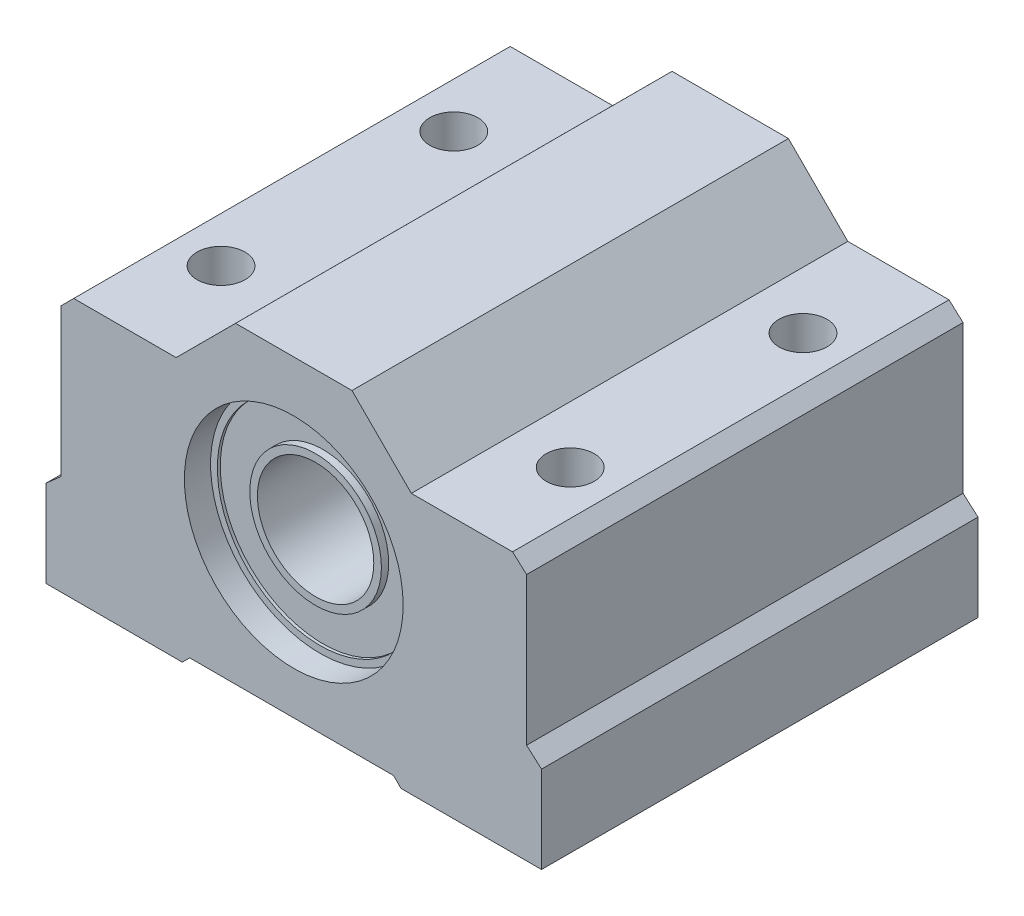
ISO-10303-21;
HEADER;
FILE_DESCRIPTION(('STEP AP214'),'2;1');
FILE_NAME('part.step','',(''),(''),'','','');
FILE_SCHEMA(('AUTOMOTIVE_DESIGN { 1 0 10303 214 1 1 1 1 }'));
ENDSEC;
DATA;
#1=APPLICATION_CONTEXT('core data for automotive mechanical design processes');
#2=APPLICATION_PROTOCOL_DEFINITION('international standard','automotive_design',2000,#1);
#3=PRODUCT_CONTEXT('',#1,'mechanical');
#4=PRODUCT('Part','Part','',(#3));
#5=PRODUCT_RELATED_PRODUCT_CATEGORY('part','',(#4));
#6=PRODUCT_DEFINITION_FORMATION('','',#4);
#7=PRODUCT_DEFINITION_CONTEXT('part definition',#1,'design');
#8=PRODUCT_DEFINITION('design','',#6,#7);
#9=PRODUCT_DEFINITION_SHAPE('','',#8);
#10=(LENGTH_UNIT() NAMED_UNIT(*) SI_UNIT(.MILLI.,.METRE.));
#11=(NAMED_UNIT(*) PLANE_ANGLE_UNIT() SI_UNIT($,.RADIAN.));
#12=(NAMED_UNIT(*) SI_UNIT($,.STERADIAN.) SOLID_ANGLE_UNIT());
#13=UNCERTAINTY_MEASURE_WITH_UNIT(LENGTH_MEASURE(1.E-05),#10,'distance_accuracy_value','');
#14=(GEOMETRIC_REPRESENTATION_CONTEXT(3) GLOBAL_UNCERTAINTY_ASSIGNED_CONTEXT((#13)) GLOBAL_UNIT_ASSIGNED_CONTEXT((#10,
#11,#12)) REPRESENTATION_CONTEXT('',''));
#15=CARTESIAN_POINT('',(0.,0.,0.));
#16=DIRECTION('',(0.,0.,1.));
#17=DIRECTION('',(1.,0.,0.));
#18=AXIS2_PLACEMENT_3D('',#15,#16,#17);
#19=CARTESIAN_POINT('',(0.,0.,-30.));
#20=DIRECTION('',(0.,0.,1.));
#21=DIRECTION('',(1.,0.,0.));
#22=AXIS2_PLACEMENT_3D('',#19,#20,#21);
#23=PLANE('',#22);
#24=DIRECTION('',(-0.748408560935745,-0.663237985882961,0.));
#25=VECTOR('',#24,1.);
#26=CARTESIAN_POINT('',(-5.00715940899254,5.65016034579369,-30.));
#27=LINE('',#26,#25);
#28=CARTESIAN_POINT('',(-15.9972160814821,-4.08920319527542,-30.));
#29=VERTEX_POINT('',#28);
#30=CARTESIAN_POINT('',(-17.03,-5.00445398438139,-30.));
#31=VERTEX_POINT('',#30);
#32=EDGE_CURVE('E253',#29,#31,#27,.T.);
#33=ORIENTED_EDGE('',*,*,#32,.F.);
#34=DIRECTION('',(0.,-1.,0.));
#35=VECTOR('',#34,1.);
#36=CARTESIAN_POINT('',(-15.9972160814821,0.,-30.));
#37=LINE('',#36,#35);
#38=CARTESIAN_POINT('',(-15.9972160814821,6.07141612040069,-30.));
#39=VERTEX_POINT('',#38);
#40=EDGE_CURVE('E191',#39,#29,#37,.T.);
#41=ORIENTED_EDGE('',*,*,#40,.F.);
#42=DIRECTION('',(-0.707106781186547,-0.707106781186548,0.));
#43=VECTOR('',#42,1.);
#44=CARTESIAN_POINT('',(-11.0343161009414,11.0343161009414,-30.));
#45=LINE('',#44,#43);
#46=CARTESIAN_POINT('',(-15.1243670871386,6.94426511474419,-30.));
#47=VERTEX_POINT('',#46);
#48=EDGE_CURVE('E176',#47,#39,#45,.T.);
#49=ORIENTED_EDGE('',*,*,#48,.F.);
#50=DIRECTION('',(-1.,0.,0.));
#51=VECTOR('',#50,1.);
#52=CARTESIAN_POINT('',(0.,6.9442651147442,-30.));
#53=LINE('',#52,#51);
#54=CARTESIAN_POINT('',(-8.083891516657,6.94426511474419,-30.));
#55=VERTEX_POINT('',#54);
#56=EDGE_CURVE('E189',#55,#47,#53,.T.);
#57=ORIENTED_EDGE('',*,*,#56,.F.);
#58=DIRECTION('',(-0.707276659522601,-0.706936862028393,0.));
#59=VECTOR('',#58,1.);
#60=CARTESIAN_POINT('',(-7.51213557308124,7.51574636915227,-30.));
#61=LINE('',#60,#59);
#62=CARTESIAN_POINT('',(-4.,11.0261946041163,-30.));
#63=VERTEX_POINT('',#62);
#64=EDGE_CURVE('E194',#63,#55,#61,.T.);
#65=ORIENTED_EDGE('',*,*,#64,.F.);
#66=DIRECTION('',(-1.,0.,0.));
#67=VECTOR('',#66,1.);
#68=CARTESIAN_POINT('',(0.,11.0261946041163,-30.));
#69=LINE('',#68,#67);
#70=CARTESIAN_POINT('',(4.,11.0261946041163,-30.));
#71=VERTEX_POINT('',#70);
#72=EDGE_CURVE('E196',#71,#63,#69,.T.);
#73=ORIENTED_EDGE('',*,*,#72,.F.);
#74=DIRECTION('',(-0.707106781186548,0.707106781186547,0.));
#75=VECTOR('',#74,1.);
#76=CARTESIAN_POINT('',(7.51309730205813,7.51309730205814,-30.));
#77=LINE('',#76,#75);
#78=CARTESIAN_POINT('',(8.0819294893721,6.94426511474417,-30.));
#79=VERTEX_POINT('',#78);
#80=EDGE_CURVE('E385',#79,#71,#77,.T.);
#81=ORIENTED_EDGE('',*,*,#80,.F.);
#82=DIRECTION('',(-1.,0.,0.));
#83=VECTOR('',#82,1.);
#84=CARTESIAN_POINT('',(0.,6.94426511474417,-30.));
#85=LINE('',#84,#83);
#86=CARTESIAN_POINT('',(15.0374546179448,6.94426511474418,-30.));
#87=VERTEX_POINT('',#86);
#88=EDGE_CURVE('E382',#87,#79,#85,.T.);
#89=ORIENTED_EDGE('',*,*,#88,.F.);
#90=DIRECTION('',(-0.741743771294362,0.670683366236272,0.));
#91=VECTOR('',#90,1.);
#92=CARTESIAN_POINT('',(10.2186901014741,11.301383208728,-30.));
#93=LINE('',#92,#91);
#94=CARTESIAN_POINT('',(16.0027839185179,6.07141612040066,-30.));
#95=VERTEX_POINT('',#94);
#96=EDGE_CURVE('E379',#95,#87,#93,.T.);
#97=ORIENTED_EDGE('',*,*,#96,.F.);
#98=DIRECTION('',(0.,1.,0.));
#99=VECTOR('',#98,1.);
#100=CARTESIAN_POINT('',(16.0027839185179,0.,-30.));
#101=LINE('',#100,#99);
#102=CARTESIAN_POINT('',(16.0027839185179,-4.08920319527547,-30.));
#103=VERTEX_POINT('',#102);
#104=EDGE_CURVE('E376',#103,#95,#101,.T.);
#105=ORIENTED_EDGE('',*,*,#104,.F.);
#106=DIRECTION('',(-0.749951735571776,0.661492550459097,0.));
#107=VECTOR('',#106,1.);
#108=CARTESIAN_POINT('',(4.97377394084638,5.63890008540626,-30.));
#109=LINE('',#108,#107);
#110=CARTESIAN_POINT('',(17.03,-4.99525588291164,-30.));
#111=VERTEX_POINT('',#110);
#112=EDGE_CURVE('E373',#111,#103,#109,.T.);
#113=ORIENTED_EDGE('',*,*,#112,.F.);
#114=DIRECTION('',(0.,1.,0.));
#115=VECTOR('',#114,1.);
#116=CARTESIAN_POINT('',(17.03,0.,-30.));
#117=LINE('',#116,#115);
#118=CARTESIAN_POINT('',(17.03,-10.9738053958837,-30.));
#119=VERTEX_POINT('',#118);
#120=EDGE_CURVE('E370',#119,#111,#117,.T.);
#121=ORIENTED_EDGE('',*,*,#120,.F.);
#122=DIRECTION('',(1.,0.,0.));
#123=VECTOR('',#122,1.);
#124=CARTESIAN_POINT('',(0.,-10.9738053958837,-30.));
#125=LINE('',#124,#123);
#126=CARTESIAN_POINT('',(7.36706184571891,-10.9738053958837,-30.));
#127=VERTEX_POINT('',#126);
#128=EDGE_CURVE('E367',#127,#119,#125,.T.);
#129=ORIENTED_EDGE('',*,*,#128,.F.);
#130=DIRECTION('',(0.707106781186548,-0.707106781186547,0.));
#131=VECTOR('',#130,1.);
#132=CARTESIAN_POINT('',(-1.80337177508242,-1.80337177508242,-30.));
#133=LINE('',#132,#131);
#134=CARTESIAN_POINT('',(6.85761623335725,-10.4643597835221,-30.));
#135=VERTEX_POINT('',#134);
#136=EDGE_CURVE('E364',#135,#127,#133,.T.);
#137=ORIENTED_EDGE('',*,*,#136,.F.);
#138=DIRECTION('',(1.,0.,0.));
#139=VECTOR('',#138,1.);
#140=CARTESIAN_POINT('',(0.,-10.4643597835221,-30.));
#141=LINE('',#140,#139);
#142=CARTESIAN_POINT('',(-7.15322917727557,-10.4643597835221,-30.));
#143=VERTEX_POINT('',#142);
#144=EDGE_CURVE('E361',#143,#135,#141,.T.);
#145=ORIENTED_EDGE('',*,*,#144,.F.);
#146=DIRECTION('',(0.707106781186549,0.707106781186546,0.));
#147=VECTOR('',#146,1.);
#148=CARTESIAN_POINT('',(1.65556530312327,-1.65556530312328,-30.));
#149=LINE('',#148,#147);
#150=CARTESIAN_POINT('',(-7.66267478963722,-10.9738053958837,-30.));
#151=VERTEX_POINT('',#150);
#152=EDGE_CURVE('E358',#151,#143,#149,.T.);
#153=ORIENTED_EDGE('',*,*,#152,.F.);
#154=DIRECTION('',(1.,0.,0.));
#155=VECTOR('',#154,1.);
#156=CARTESIAN_POINT('',(0.,-10.9738053958837,-30.));
#157=LINE('',#156,#155);
#158=CARTESIAN_POINT('',(-17.03,-10.9738053958837,-30.));
#159=VERTEX_POINT('',#158);
#160=EDGE_CURVE('E355',#159,#151,#157,.T.);
#161=ORIENTED_EDGE('',*,*,#160,.F.);
#162=DIRECTION('',(0.,-1.,0.));
#163=VECTOR('',#162,1.);
#164=CARTESIAN_POINT('',(-17.03,0.,-30.));
#165=LINE('',#164,#163);
#166=EDGE_CURVE('E353',#31,#159,#165,.T.);
#167=ORIENTED_EDGE('',*,*,#166,.F.);
#168=EDGE_LOOP('',(#33,#41,#49,#57,#65,#73,#81,#89,#97,#105,#113,#121,#129,#137,#145,#153,#161,#167));
#169=FACE_BOUND('',#168,.T.);
#170=CARTESIAN_POINT('',(0.,0.,-30.));
#171=DIRECTION('',(0.,0.,1.));
#172=DIRECTION('',(1.,0.,0.));
#173=AXIS2_PLACEMENT_3D('',#170,#171,#172);
#174=CIRCLE('',#173,7.51901731530374);
#175=CARTESIAN_POINT('',(7.51901731530374,0.,-30.));
#176=VERTEX_POINT('',#175);
#177=EDGE_CURVE('E328',#176,#176,#174,.T.);
#178=ORIENTED_EDGE('',*,*,#177,.T.);
#179=EDGE_LOOP('',(#178));
#180=FACE_BOUND('',#179,.T.);
#181=ADVANCED_FACE('F42',(#169,#180),#23,.F.);
#182=CARTESIAN_POINT('',(0.,0.,-2.));
#183=DIRECTION('',(0.,0.,1.));
#184=DIRECTION('',(1.,0.,0.));
#185=AXIS2_PLACEMENT_3D('',#182,#183,#184);
#186=CYLINDRICAL_SURFACE('',#185,7.0517883155918);
#187=CARTESIAN_POINT('',(0.,0.,-2.));
#188=DIRECTION('',(0.,0.,1.));
#189=DIRECTION('',(1.,0.,0.));
#190=AXIS2_PLACEMENT_3D('',#187,#188,#189);
#191=CIRCLE('',#190,7.0517883155918);
#192=CARTESIAN_POINT('',(7.0517883155918,0.,-2.));
#193=VERTEX_POINT('',#192);
#194=EDGE_CURVE('E335',#193,#193,#191,.T.);
#195=ORIENTED_EDGE('',*,*,#194,.F.);
#196=EDGE_LOOP('',(#195));
#197=FACE_BOUND('',#196,.T.);
#198=CARTESIAN_POINT('',(0.,0.,-1.8));
#199=DIRECTION('',(0.,0.,1.));
#200=DIRECTION('',(1.,0.,0.));
#201=AXIS2_PLACEMENT_3D('',#198,#199,#200);
#202=CIRCLE('',#201,7.0517883155918);
#203=CARTESIAN_POINT('',(7.0517883155918,0.,-1.8));
#204=VERTEX_POINT('',#203);
#205=EDGE_CURVE('E321',#204,#204,#202,.T.);
#206=ORIENTED_EDGE('',*,*,#205,.T.);
#207=EDGE_LOOP('',(#206));
#208=FACE_BOUND('',#207,.T.);
#209=ADVANCED_FACE('F297',(#197,#208),#186,.F.);
#210=CARTESIAN_POINT('',(0.,0.,-28.5));
#211=DIRECTION('',(0.,0.,1.));
#212=DIRECTION('',(1.,0.,0.));
#213=AXIS2_PLACEMENT_3D('',#210,#211,#212);
#214=CYLINDRICAL_SURFACE('',#213,4.);
#215=CARTESIAN_POINT('',(0.,0.,-28.5));
#216=DIRECTION('',(0.,0.,1.));
#217=DIRECTION('',(1.,0.,0.));
#218=AXIS2_PLACEMENT_3D('',#215,#216,#217);
#219=CIRCLE('',#218,4.);
#220=CARTESIAN_POINT('',(4.,0.,-28.5));
#221=VERTEX_POINT('',#220);
#222=EDGE_CURVE('E344',#221,#221,#219,.T.);
#223=ORIENTED_EDGE('',*,*,#222,.F.);
#224=EDGE_LOOP('',(#223));
#225=FACE_BOUND('',#224,.T.);
#226=CARTESIAN_POINT('',(0.,0.,-1.5));
#227=DIRECTION('',(0.,0.,1.));
#228=DIRECTION('',(1.,0.,0.));
#229=AXIS2_PLACEMENT_3D('',#226,#227,#228);
#230=CIRCLE('',#229,4.);
#231=CARTESIAN_POINT('',(4.,0.,-1.5));
#232=VERTEX_POINT('',#231);
#233=EDGE_CURVE('E341',#232,#232,#230,.T.);
#234=ORIENTED_EDGE('',*,*,#233,.T.);
#235=EDGE_LOOP('',(#234));
#236=FACE_BOUND('',#235,.T.);
#237=ADVANCED_FACE('F302',(#225,#236),#214,.F.);
#238=CARTESIAN_POINT('',(0.,0.,-30.));
#239=DIRECTION('',(0.,0.,1.));
#240=DIRECTION('',(1.,0.,0.));
#241=AXIS2_PLACEMENT_3D('',#238,#239,#240);
#242=CYLINDRICAL_SURFACE('',#241,7.0517883155918);
#243=CARTESIAN_POINT('',(0.,0.,-28.2));
#244=DIRECTION('',(0.,0.,1.));
#245=DIRECTION('',(1.,0.,0.));
#246=AXIS2_PLACEMENT_3D('',#243,#244,#245);
#247=CIRCLE('',#246,7.0517883155918);
#248=CARTESIAN_POINT('',(7.0517883155918,0.,-28.2));
#249=VERTEX_POINT('',#248);
#250=EDGE_CURVE('E485',#249,#249,#247,.T.);
#251=ORIENTED_EDGE('',*,*,#250,.F.);
#252=EDGE_LOOP('',(#251));
#253=FACE_BOUND('',#252,.T.);
#254=CARTESIAN_POINT('',(0.,0.,-28.));
#255=DIRECTION('',(0.,0.,1.));
#256=DIRECTION('',(1.,0.,0.));
#257=AXIS2_PLACEMENT_3D('',#254,#255,#256);
#258=CIRCLE('',#257,7.0517883155918);
#259=CARTESIAN_POINT('',(7.0517883155918,0.,-28.));
#260=VERTEX_POINT('',#259);
#261=EDGE_CURVE('E12',#260,#260,#258,.F.);
#262=ORIENTED_EDGE('',*,*,#261,.F.);
#263=EDGE_LOOP('',(#262));
#264=FACE_BOUND('',#263,.T.);
#265=ADVANCED_FACE('F294',(#253,#264),#242,.F.);
#266=CARTESIAN_POINT('',(-5.00715940899254,5.65016034579369,-30.));
#267=DIRECTION('',(-0.663237985882961,0.748408560935745,0.));
#268=DIRECTION('',(-0.748408560935745,-0.663237985882961,0.));
#269=AXIS2_PLACEMENT_3D('',#266,#267,#268);
#270=PLANE('',#269);
#271=DIRECTION('',(-0.748408560935745,-0.663237985882961,0.));
#272=VECTOR('',#271,1.);
#273=CARTESIAN_POINT('',(-5.00715940899254,5.65016034579369,0.));
#274=LINE('',#273,#272);
#275=CARTESIAN_POINT('',(-15.9972160814821,-4.08920319527542,0.));
#276=VERTEX_POINT('',#275);
#277=CARTESIAN_POINT('',(-17.03,-5.00445398438139,0.));
#278=VERTEX_POINT('',#277);
#279=EDGE_CURVE('E201',#276,#278,#274,.T.);
#280=ORIENTED_EDGE('',*,*,#279,.F.);
#281=DIRECTION('',(0.,0.,1.));
#282=VECTOR('',#281,1.);
#283=CARTESIAN_POINT('',(-15.9972160814821,-4.08920319527542,-30.));
#284=LINE('',#283,#282);
#285=EDGE_CURVE('E51',#29,#276,#284,.T.);
#286=ORIENTED_EDGE('',*,*,#285,.F.);
#287=ORIENTED_EDGE('',*,*,#32,.T.);
#288=DIRECTION('',(0.,0.,1.));
#289=VECTOR('',#288,1.);
#290=CARTESIAN_POINT('',(-17.03,-5.00445398438139,-30.));
#291=LINE('',#290,#289);
#292=EDGE_CURVE('E129',#31,#278,#291,.T.);
#293=ORIENTED_EDGE('',*,*,#292,.T.);
#294=EDGE_LOOP('',(#280,#286,#287,#293));
#295=FACE_BOUND('',#294,.T.);
#296=ADVANCED_FACE('F44',(#295),#270,.T.);
#297=CARTESIAN_POINT('',(-15.9972160814821,0.,-30.));
#298=DIRECTION('',(-1.,0.,0.));
#299=DIRECTION('',(0.,0.,1.));
#300=AXIS2_PLACEMENT_3D('',#297,#298,#299);
#301=PLANE('',#300);
#302=DIRECTION('',(0.,-1.,0.));
#303=VECTOR('',#302,1.);
#304=CARTESIAN_POINT('',(-15.9972160814821,0.,0.));
#305=LINE('',#304,#303);
#306=CARTESIAN_POINT('',(-15.9972160814821,6.07141612040069,0.));
#307=VERTEX_POINT('',#306);
#308=EDGE_CURVE('E250',#307,#276,#305,.T.);
#309=ORIENTED_EDGE('',*,*,#308,.F.);
#310=DIRECTION('',(0.,0.,1.));
#311=VECTOR('',#310,1.);
#312=CARTESIAN_POINT('',(-15.9972160814821,6.07141612040069,-30.));
#313=LINE('',#312,#311);
#314=EDGE_CURVE('E117',#39,#307,#313,.T.);
#315=ORIENTED_EDGE('',*,*,#314,.F.);
#316=ORIENTED_EDGE('',*,*,#40,.T.);
#317=ORIENTED_EDGE('',*,*,#285,.T.);
#318=EDGE_LOOP('',(#309,#315,#316,#317));
#319=FACE_BOUND('',#318,.T.);
#320=ADVANCED_FACE('F286',(#319),#301,.T.);
#321=CARTESIAN_POINT('',(-11.0343161009414,11.0343161009414,-30.));
#322=DIRECTION('',(-0.707106781186548,0.707106781186547,0.));
#323=DIRECTION('',(-0.707106781186547,-0.707106781186548,0.));
#324=AXIS2_PLACEMENT_3D('',#321,#322,#323);
#325=PLANE('',#324);
#326=DIRECTION('',(-0.707106781186547,-0.707106781186548,0.));
#327=VECTOR('',#326,1.);
#328=CARTESIAN_POINT('',(-11.0343161009414,11.0343161009414,0.));
#329=LINE('',#328,#327);
#330=CARTESIAN_POINT('',(-15.1243670871386,6.94426511474419,0.));
#331=VERTEX_POINT('',#330);
#332=EDGE_CURVE('E178',#331,#307,#329,.T.);
#333=ORIENTED_EDGE('',*,*,#332,.F.);
#334=DIRECTION('',(0.,0.,1.));
#335=VECTOR('',#334,1.);
#336=CARTESIAN_POINT('',(-15.1243670871386,6.94426511474419,-30.));
#337=LINE('',#336,#335);
#338=EDGE_CURVE('E173',#47,#331,#337,.T.);
#339=ORIENTED_EDGE('',*,*,#338,.F.);
#340=ORIENTED_EDGE('',*,*,#48,.T.);
#341=ORIENTED_EDGE('',*,*,#314,.T.);
#342=EDGE_LOOP('',(#333,#339,#340,#341));
#343=FACE_BOUND('',#342,.T.);
#344=ADVANCED_FACE('F175',(#343),#325,.T.);
#345=CARTESIAN_POINT('',(0.,6.9442651147442,-30.));
#346=DIRECTION('',(0.,1.,0.));
#347=DIRECTION('',(-1.,0.,0.));
#348=AXIS2_PLACEMENT_3D('',#345,#346,#347);
#349=PLANE('',#348);
#350=CARTESIAN_POINT('',(-12.,6.9442651147442,-23.));
#351=DIRECTION('',(0.,1.,0.));
#352=DIRECTION('',(-1.,0.,0.));
#353=AXIS2_PLACEMENT_3D('',#350,#351,#352);
#354=CIRCLE('',#353,1.65);
#355=CARTESIAN_POINT('',(-13.65,6.9442651147442,-23.));
#356=VERTEX_POINT('',#355);
#357=EDGE_CURVE('E482',#356,#356,#354,.T.);
#358=ORIENTED_EDGE('',*,*,#357,.F.);
#359=EDGE_LOOP('',(#358));
#360=FACE_BOUND('',#359,.T.);
#361=CARTESIAN_POINT('',(-12.,6.9442651147442,-7.));
#362=DIRECTION('',(0.,1.,0.));
#363=DIRECTION('',(-1.,0.,0.));
#364=AXIS2_PLACEMENT_3D('',#361,#362,#363);
#365=CIRCLE('',#364,1.65);
#366=CARTESIAN_POINT('',(-13.65,6.9442651147442,-7.));
#367=VERTEX_POINT('',#366);
#368=EDGE_CURVE('E481',#367,#367,#365,.T.);
#369=ORIENTED_EDGE('',*,*,#368,.F.);
#370=EDGE_LOOP('',(#369));
#371=FACE_BOUND('',#370,.T.);
#372=DIRECTION('',(-1.,0.,0.));
#373=VECTOR('',#372,1.);
#374=CARTESIAN_POINT('',(0.,6.9442651147442,0.));
#375=LINE('',#374,#373);
#376=CARTESIAN_POINT('',(-8.083891516657,6.94426511474419,0.));
#377=VERTEX_POINT('',#376);
#378=EDGE_CURVE('E247',#377,#331,#375,.T.);
#379=ORIENTED_EDGE('',*,*,#378,.F.);
#380=DIRECTION('',(0.,0.,1.));
#381=VECTOR('',#380,1.);
#382=CARTESIAN_POINT('',(-8.083891516657,6.94426511474419,-30.));
#383=LINE('',#382,#381);
#384=EDGE_CURVE('E183',#55,#377,#383,.T.);
#385=ORIENTED_EDGE('',*,*,#384,.F.);
#386=ORIENTED_EDGE('',*,*,#56,.T.);
#387=ORIENTED_EDGE('',*,*,#338,.T.);
#388=EDGE_LOOP('',(#379,#385,#386,#387));
#389=FACE_BOUND('',#388,.T.);
#390=ADVANCED_FACE('F193',(#360,#371,#389),#349,.T.);
#391=CARTESIAN_POINT('',(-7.51213557308124,7.51574636915227,-30.));
#392=DIRECTION('',(-0.706936862028393,0.707276659522601,0.));
#393=DIRECTION('',(-0.707276659522601,-0.706936862028393,0.));
#394=AXIS2_PLACEMENT_3D('',#391,#392,#393);
#395=PLANE('',#394);
#396=DIRECTION('',(-0.707276659522601,-0.706936862028393,0.));
#397=VECTOR('',#396,1.);
#398=CARTESIAN_POINT('',(-7.51213557308124,7.51574636915227,0.));
#399=LINE('',#398,#397);
#400=CARTESIAN_POINT('',(-4.,11.0261946041163,0.));
#401=VERTEX_POINT('',#400);
#402=EDGE_CURVE('E244',#401,#377,#399,.T.);
#403=ORIENTED_EDGE('',*,*,#402,.F.);
#404=DIRECTION('',(0.,0.,1.));
#405=VECTOR('',#404,1.);
#406=CARTESIAN_POINT('',(-4.,11.0261946041163,-30.));
#407=LINE('',#406,#405);
#408=EDGE_CURVE('E257',#63,#401,#407,.T.);
#409=ORIENTED_EDGE('',*,*,#408,.F.);
#410=ORIENTED_EDGE('',*,*,#64,.T.);
#411=ORIENTED_EDGE('',*,*,#384,.T.);
#412=EDGE_LOOP('',(#403,#409,#410,#411));
#413=FACE_BOUND('',#412,.T.);
#414=ADVANCED_FACE('F436',(#413),#395,.T.);
#415=CARTESIAN_POINT('',(0.,11.0261946041163,-30.));
#416=DIRECTION('',(0.,1.,0.));
#417=DIRECTION('',(-1.,0.,0.));
#418=AXIS2_PLACEMENT_3D('',#415,#416,#417);
#419=PLANE('',#418);
#420=DIRECTION('',(-1.,0.,0.));
#421=VECTOR('',#420,1.);
#422=CARTESIAN_POINT('',(0.,11.0261946041163,0.));
#423=LINE('',#422,#421);
#424=CARTESIAN_POINT('',(4.,11.0261946041163,0.));
#425=VERTEX_POINT('',#424);
#426=EDGE_CURVE('E241',#425,#401,#423,.T.);
#427=ORIENTED_EDGE('',*,*,#426,.F.);
#428=DIRECTION('',(0.,0.,1.));
#429=VECTOR('',#428,1.);
#430=CARTESIAN_POINT('',(4.,11.0261946041163,-30.));
#431=LINE('',#430,#429);
#432=EDGE_CURVE('E259',#71,#425,#431,.T.);
#433=ORIENTED_EDGE('',*,*,#432,.F.);
#434=ORIENTED_EDGE('',*,*,#72,.T.);
#435=ORIENTED_EDGE('',*,*,#408,.T.);
#436=EDGE_LOOP('',(#427,#433,#434,#435));
#437=FACE_BOUND('',#436,.T.);
#438=ADVANCED_FACE('F391',(#437),#419,.T.);
#439=CARTESIAN_POINT('',(7.51309730205813,7.51309730205814,-30.));
#440=DIRECTION('',(0.707106781186547,0.707106781186548,0.));
#441=DIRECTION('',(-0.707106781186548,0.707106781186547,0.));
#442=AXIS2_PLACEMENT_3D('',#439,#440,#441);
#443=PLANE('',#442);
#444=DIRECTION('',(-0.707106781186548,0.707106781186547,0.));
#445=VECTOR('',#444,1.);
#446=CARTESIAN_POINT('',(7.51309730205813,7.51309730205814,0.));
#447=LINE('',#446,#445);
#448=CARTESIAN_POINT('',(8.0819294893721,6.94426511474417,0.));
#449=VERTEX_POINT('',#448);
#450=EDGE_CURVE('E238',#449,#425,#447,.T.);
#451=ORIENTED_EDGE('',*,*,#450,.F.);
#452=DIRECTION('',(0.,0.,1.));
#453=VECTOR('',#452,1.);
#454=CARTESIAN_POINT('',(8.0819294893721,6.94426511474417,-30.));
#455=LINE('',#454,#453);
#456=EDGE_CURVE('E261',#79,#449,#455,.T.);
#457=ORIENTED_EDGE('',*,*,#456,.F.);
#458=ORIENTED_EDGE('',*,*,#80,.T.);
#459=ORIENTED_EDGE('',*,*,#432,.T.);
#460=EDGE_LOOP('',(#451,#457,#458,#459));
#461=FACE_BOUND('',#460,.T.);
#462=ADVANCED_FACE('F397',(#461),#443,.T.);
#463=CARTESIAN_POINT('',(0.,6.94426511474417,-30.));
#464=DIRECTION('',(0.,1.,0.));
#465=DIRECTION('',(-1.,0.,0.));
#466=AXIS2_PLACEMENT_3D('',#463,#464,#465);
#467=PLANE('',#466);
#468=CARTESIAN_POINT('',(12.,6.94426511474417,-7.));
#469=DIRECTION('',(0.,1.,0.));
#470=DIRECTION('',(-1.,0.,0.));
#471=AXIS2_PLACEMENT_3D('',#468,#469,#470);
#472=CIRCLE('',#471,1.65);
#473=CARTESIAN_POINT('',(10.35,6.94426511474417,-7.));
#474=VERTEX_POINT('',#473);
#475=EDGE_CURVE('E793',#474,#474,#472,.T.);
#476=ORIENTED_EDGE('',*,*,#475,.F.);
#477=EDGE_LOOP('',(#476));
#478=FACE_BOUND('',#477,.T.);
#479=CARTESIAN_POINT('',(12.,6.94426511474417,-23.));
#480=DIRECTION('',(0.,1.,0.));
#481=DIRECTION('',(-1.,0.,0.));
#482=AXIS2_PLACEMENT_3D('',#479,#480,#481);
#483=CIRCLE('',#482,1.65);
#484=CARTESIAN_POINT('',(10.35,6.94426511474417,-23.));
#485=VERTEX_POINT('',#484);
#486=EDGE_CURVE('E803',#485,#485,#483,.T.);
#487=ORIENTED_EDGE('',*,*,#486,.F.);
#488=EDGE_LOOP('',(#487));
#489=FACE_BOUND('',#488,.T.);
#490=DIRECTION('',(-1.,0.,0.));
#491=VECTOR('',#490,1.);
#492=CARTESIAN_POINT('',(0.,6.94426511474417,0.));
#493=LINE('',#492,#491);
#494=CARTESIAN_POINT('',(15.0374546179448,6.94426511474418,0.));
#495=VERTEX_POINT('',#494);
#496=EDGE_CURVE('E235',#495,#449,#493,.T.);
#497=ORIENTED_EDGE('',*,*,#496,.F.);
#498=DIRECTION('',(0.,0.,1.));
#499=VECTOR('',#498,1.);
#500=CARTESIAN_POINT('',(15.0374546179448,6.94426511474418,-30.));
#501=LINE('',#500,#499);
#502=EDGE_CURVE('E263',#87,#495,#501,.T.);
#503=ORIENTED_EDGE('',*,*,#502,.F.);
#504=ORIENTED_EDGE('',*,*,#88,.T.);
#505=ORIENTED_EDGE('',*,*,#456,.T.);
#506=EDGE_LOOP('',(#497,#503,#504,#505));
#507=FACE_BOUND('',#506,.T.);
#508=ADVANCED_FACE('F400',(#478,#489,#507),#467,.T.);
#509=CARTESIAN_POINT('',(10.2186901014741,11.301383208728,-30.));
#510=DIRECTION('',(0.670683366236272,0.741743771294362,0.));
#511=DIRECTION('',(-0.741743771294362,0.670683366236272,0.));
#512=AXIS2_PLACEMENT_3D('',#509,#510,#511);
#513=PLANE('',#512);
#514=DIRECTION('',(-0.741743771294362,0.670683366236272,0.));
#515=VECTOR('',#514,1.);
#516=CARTESIAN_POINT('',(10.2186901014741,11.301383208728,0.));
#517=LINE('',#516,#515);
#518=CARTESIAN_POINT('',(16.0027839185179,6.07141612040066,0.));
#519=VERTEX_POINT('',#518);
#520=EDGE_CURVE('E232',#519,#495,#517,.T.);
#521=ORIENTED_EDGE('',*,*,#520,.F.);
#522=DIRECTION('',(0.,0.,1.));
#523=VECTOR('',#522,1.);
#524=CARTESIAN_POINT('',(16.0027839185179,6.07141612040066,-30.));
#525=LINE('',#524,#523);
#526=EDGE_CURVE('E265',#95,#519,#525,.T.);
#527=ORIENTED_EDGE('',*,*,#526,.F.);
#528=ORIENTED_EDGE('',*,*,#96,.T.);
#529=ORIENTED_EDGE('',*,*,#502,.T.);
#530=EDGE_LOOP('',(#521,#527,#528,#529));
#531=FACE_BOUND('',#530,.T.);
#532=ADVANCED_FACE('F405',(#531),#513,.T.);
#533=CARTESIAN_POINT('',(16.0027839185179,0.,-30.));
#534=DIRECTION('',(1.,0.,0.));
#535=DIRECTION('',(0.,0.,-1.));
#536=AXIS2_PLACEMENT_3D('',#533,#534,#535);
#537=PLANE('',#536);
#538=DIRECTION('',(0.,1.,0.));
#539=VECTOR('',#538,1.);
#540=CARTESIAN_POINT('',(16.0027839185179,0.,0.));
#541=LINE('',#540,#539);
#542=CARTESIAN_POINT('',(16.0027839185179,-4.08920319527547,0.));
#543=VERTEX_POINT('',#542);
#544=EDGE_CURVE('E229',#543,#519,#541,.T.);
#545=ORIENTED_EDGE('',*,*,#544,.F.);
#546=DIRECTION('',(0.,0.,1.));
#547=VECTOR('',#546,1.);
#548=CARTESIAN_POINT('',(16.0027839185179,-4.08920319527547,-30.));
#549=LINE('',#548,#547);
#550=EDGE_CURVE('E267',#103,#543,#549,.T.);
#551=ORIENTED_EDGE('',*,*,#550,.F.);
#552=ORIENTED_EDGE('',*,*,#104,.T.);
#553=ORIENTED_EDGE('',*,*,#526,.T.);
#554=EDGE_LOOP('',(#545,#551,#552,#553));
#555=FACE_BOUND('',#554,.T.);
#556=ADVANCED_FACE('F408',(#555),#537,.T.);
#557=CARTESIAN_POINT('',(4.97377394084638,5.63890008540626,-30.));
#558=DIRECTION('',(0.661492550459097,0.749951735571776,0.));
#559=DIRECTION('',(-0.749951735571776,0.661492550459097,0.));
#560=AXIS2_PLACEMENT_3D('',#557,#558,#559);
#561=PLANE('',#560);
#562=DIRECTION('',(-0.749951735571776,0.661492550459097,0.));
#563=VECTOR('',#562,1.);
#564=CARTESIAN_POINT('',(4.97377394084638,5.63890008540626,0.));
#565=LINE('',#564,#563);
#566=CARTESIAN_POINT('',(17.03,-4.99525588291164,0.));
#567=VERTEX_POINT('',#566);
#568=EDGE_CURVE('E226',#567,#543,#565,.T.);
#569=ORIENTED_EDGE('',*,*,#568,.F.);
#570=DIRECTION('',(0.,0.,1.));
#571=VECTOR('',#570,1.);
#572=CARTESIAN_POINT('',(17.03,-4.99525588291164,-30.));
#573=LINE('',#572,#571);
#574=EDGE_CURVE('E269',#111,#567,#573,.T.);
#575=ORIENTED_EDGE('',*,*,#574,.F.);
#576=ORIENTED_EDGE('',*,*,#112,.T.);
#577=ORIENTED_EDGE('',*,*,#550,.T.);
#578=EDGE_LOOP('',(#569,#575,#576,#577));
#579=FACE_BOUND('',#578,.T.);
#580=ADVANCED_FACE('F413',(#579),#561,.T.);
#581=CARTESIAN_POINT('',(17.03,0.,-30.));
#582=DIRECTION('',(1.,0.,0.));
#583=DIRECTION('',(0.,0.,-1.));
#584=AXIS2_PLACEMENT_3D('',#581,#582,#583);
#585=PLANE('',#584);
#586=DIRECTION('',(0.,1.,0.));
#587=VECTOR('',#586,1.);
#588=CARTESIAN_POINT('',(17.03,0.,0.));
#589=LINE('',#588,#587);
#590=CARTESIAN_POINT('',(17.03,-10.9738053958837,0.));
#591=VERTEX_POINT('',#590);
#592=EDGE_CURVE('E223',#591,#567,#589,.T.);
#593=ORIENTED_EDGE('',*,*,#592,.F.);
#594=DIRECTION('',(0.,0.,1.));
#595=VECTOR('',#594,1.);
#596=CARTESIAN_POINT('',(17.03,-10.9738053958837,-30.));
#597=LINE('',#596,#595);
#598=EDGE_CURVE('E271',#119,#591,#597,.T.);
#599=ORIENTED_EDGE('',*,*,#598,.F.);
#600=ORIENTED_EDGE('',*,*,#120,.T.);
#601=ORIENTED_EDGE('',*,*,#574,.T.);
#602=EDGE_LOOP('',(#593,#599,#600,#601));
#603=FACE_BOUND('',#602,.T.);
#604=ADVANCED_FACE('F416',(#603),#585,.T.);
#605=CARTESIAN_POINT('',(0.,-10.9738053958837,-30.));
#606=DIRECTION('',(0.,-1.,0.));
#607=DIRECTION('',(0.,0.,-1.));
#608=AXIS2_PLACEMENT_3D('',#605,#606,#607);
#609=PLANE('',#608);
#610=CARTESIAN_POINT('',(12.,-10.9738053958837,-7.));
#611=DIRECTION('',(0.,-1.,0.));
#612=DIRECTION('',(0.,0.,-1.));
#613=AXIS2_PLACEMENT_3D('',#610,#611,#612);
#614=CIRCLE('',#613,1.65);
#615=CARTESIAN_POINT('',(12.,-10.9738053958837,-8.65));
#616=VERTEX_POINT('',#615);
#617=EDGE_CURVE('E796',#616,#616,#614,.T.);
#618=ORIENTED_EDGE('',*,*,#617,.F.);
#619=EDGE_LOOP('',(#618));
#620=FACE_BOUND('',#619,.T.);
#621=CARTESIAN_POINT('',(12.,-10.9738053958837,-23.));
#622=DIRECTION('',(0.,-1.,0.));
#623=DIRECTION('',(0.,0.,-1.));
#624=AXIS2_PLACEMENT_3D('',#621,#622,#623);
#625=CIRCLE('',#624,1.65);
#626=CARTESIAN_POINT('',(12.,-10.9738053958837,-24.65));
#627=VERTEX_POINT('',#626);
#628=EDGE_CURVE('E798',#627,#627,#625,.T.);
#629=ORIENTED_EDGE('',*,*,#628,.F.);
#630=EDGE_LOOP('',(#629));
#631=FACE_BOUND('',#630,.T.);
#632=DIRECTION('',(1.,0.,0.));
#633=VECTOR('',#632,1.);
#634=CARTESIAN_POINT('',(0.,-10.9738053958837,0.));
#635=LINE('',#634,#633);
#636=CARTESIAN_POINT('',(7.36706184571891,-10.9738053958837,0.));
#637=VERTEX_POINT('',#636);
#638=EDGE_CURVE('E220',#637,#591,#635,.T.);
#639=ORIENTED_EDGE('',*,*,#638,.F.);
#640=DIRECTION('',(0.,0.,1.));
#641=VECTOR('',#640,1.);
#642=CARTESIAN_POINT('',(7.36706184571891,-10.9738053958837,-30.));
#643=LINE('',#642,#641);
#644=EDGE_CURVE('E273',#127,#637,#643,.T.);
#645=ORIENTED_EDGE('',*,*,#644,.F.);
#646=ORIENTED_EDGE('',*,*,#128,.T.);
#647=ORIENTED_EDGE('',*,*,#598,.T.);
#648=EDGE_LOOP('',(#639,#645,#646,#647));
#649=FACE_BOUND('',#648,.T.);
#650=ADVANCED_FACE('F421',(#620,#631,#649),#609,.T.);
#651=CARTESIAN_POINT('',(-1.80337177508242,-1.80337177508242,-30.));
#652=DIRECTION('',(-0.707106781186547,-0.707106781186548,0.));
#653=DIRECTION('',(0.707106781186548,-0.707106781186547,0.));
#654=AXIS2_PLACEMENT_3D('',#651,#652,#653);
#655=PLANE('',#654);
#656=DIRECTION('',(0.707106781186548,-0.707106781186547,0.));
#657=VECTOR('',#656,1.);
#658=CARTESIAN_POINT('',(-1.80337177508242,-1.80337177508242,0.));
#659=LINE('',#658,#657);
#660=CARTESIAN_POINT('',(6.85761623335725,-10.4643597835221,0.));
#661=VERTEX_POINT('',#660);
#662=EDGE_CURVE('E217',#661,#637,#659,.T.);
#663=ORIENTED_EDGE('',*,*,#662,.F.);
#664=DIRECTION('',(0.,0.,1.));
#665=VECTOR('',#664,1.);
#666=CARTESIAN_POINT('',(6.85761623335725,-10.4643597835221,-30.));
#667=LINE('',#666,#665);
#668=EDGE_CURVE('E275',#135,#661,#667,.T.);
#669=ORIENTED_EDGE('',*,*,#668,.F.);
#670=ORIENTED_EDGE('',*,*,#136,.T.);
#671=ORIENTED_EDGE('',*,*,#644,.T.);
#672=EDGE_LOOP('',(#663,#669,#670,#671));
#673=FACE_BOUND('',#672,.T.);
#674=ADVANCED_FACE('F424',(#673),#655,.T.);
#675=CARTESIAN_POINT('',(0.,-10.4643597835221,-30.));
#676=DIRECTION('',(0.,-1.,0.));
#677=DIRECTION('',(0.,0.,-1.));
#678=AXIS2_PLACEMENT_3D('',#675,#676,#677);
#679=PLANE('',#678);
#680=DIRECTION('',(1.,0.,0.));
#681=VECTOR('',#680,1.);
#682=CARTESIAN_POINT('',(0.,-10.4643597835221,0.));
#683=LINE('',#682,#681);
#684=CARTESIAN_POINT('',(-7.15322917727557,-10.4643597835221,0.));
#685=VERTEX_POINT('',#684);
#686=EDGE_CURVE('E214',#685,#661,#683,.T.);
#687=ORIENTED_EDGE('',*,*,#686,.F.);
#688=DIRECTION('',(0.,0.,1.));
#689=VECTOR('',#688,1.);
#690=CARTESIAN_POINT('',(-7.15322917727557,-10.4643597835221,-30.));
#691=LINE('',#690,#689);
#692=EDGE_CURVE('E277',#143,#685,#691,.T.);
#693=ORIENTED_EDGE('',*,*,#692,.F.);
#694=ORIENTED_EDGE('',*,*,#144,.T.);
#695=ORIENTED_EDGE('',*,*,#668,.T.);
#696=EDGE_LOOP('',(#687,#693,#694,#695));
#697=FACE_BOUND('',#696,.T.);
#698=ADVANCED_FACE('F429',(#697),#679,.T.);
#699=CARTESIAN_POINT('',(1.65556530312327,-1.65556530312328,-30.));
#700=DIRECTION('',(0.707106781186546,-0.707106781186549,0.));
#701=DIRECTION('',(0.707106781186549,0.707106781186546,0.));
#702=AXIS2_PLACEMENT_3D('',#699,#700,#701);
#703=PLANE('',#702);
#704=DIRECTION('',(0.707106781186549,0.707106781186546,0.));
#705=VECTOR('',#704,1.);
#706=CARTESIAN_POINT('',(1.65556530312327,-1.65556530312328,0.));
#707=LINE('',#706,#705);
#708=CARTESIAN_POINT('',(-7.66267478963722,-10.9738053958837,0.));
#709=VERTEX_POINT('',#708);
#710=EDGE_CURVE('E211',#709,#685,#707,.T.);
#711=ORIENTED_EDGE('',*,*,#710,.F.);
#712=DIRECTION('',(0.,0.,1.));
#713=VECTOR('',#712,1.);
#714=CARTESIAN_POINT('',(-7.66267478963722,-10.9738053958837,-30.));
#715=LINE('',#714,#713);
#716=EDGE_CURVE('E279',#151,#709,#715,.T.);
#717=ORIENTED_EDGE('',*,*,#716,.F.);
#718=ORIENTED_EDGE('',*,*,#152,.T.);
#719=ORIENTED_EDGE('',*,*,#692,.T.);
#720=EDGE_LOOP('',(#711,#717,#718,#719));
#721=FACE_BOUND('',#720,.T.);
#722=ADVANCED_FACE('F432',(#721),#703,.T.);
#723=CARTESIAN_POINT('',(0.,-10.9738053958837,-30.));
#724=DIRECTION('',(0.,-1.,0.));
#725=DIRECTION('',(1.,0.,0.));
#726=AXIS2_PLACEMENT_3D('',#723,#724,#725);
#727=PLANE('',#726);
#728=CARTESIAN_POINT('',(-12.,-10.9738053958837,-23.));
#729=DIRECTION('',(0.,-1.,0.));
#730=DIRECTION('',(0.,0.,-1.));
#731=AXIS2_PLACEMENT_3D('',#728,#729,#730);
#732=CIRCLE('',#731,1.65);
#733=CARTESIAN_POINT('',(-12.,-10.9738053958837,-24.65));
#734=VERTEX_POINT('',#733);
#735=EDGE_CURVE('E476',#734,#734,#732,.T.);
#736=ORIENTED_EDGE('',*,*,#735,.F.);
#737=EDGE_LOOP('',(#736));
#738=FACE_BOUND('',#737,.T.);
#739=CARTESIAN_POINT('',(-12.,-10.9738053958837,-7.));
#740=DIRECTION('',(0.,-1.,0.));
#741=DIRECTION('',(0.,0.,-1.));
#742=AXIS2_PLACEMENT_3D('',#739,#740,#741);
#743=CIRCLE('',#742,1.65);
#744=CARTESIAN_POINT('',(-12.,-10.9738053958837,-8.65));
#745=VERTEX_POINT('',#744);
#746=EDGE_CURVE('E479',#745,#745,#743,.T.);
#747=ORIENTED_EDGE('',*,*,#746,.F.);
#748=EDGE_LOOP('',(#747));
#749=FACE_BOUND('',#748,.T.);
#750=DIRECTION('',(1.,0.,0.));
#751=VECTOR('',#750,1.);
#752=CARTESIAN_POINT('',(0.,-10.9738053958837,0.));
#753=LINE('',#752,#751);
#754=CARTESIAN_POINT('',(-17.03,-10.9738053958837,0.));
#755=VERTEX_POINT('',#754);
#756=EDGE_CURVE('E208',#755,#709,#753,.T.);
#757=ORIENTED_EDGE('',*,*,#756,.F.);
#758=DIRECTION('',(0.,0.,1.));
#759=VECTOR('',#758,1.);
#760=CARTESIAN_POINT('',(-17.03,-10.9738053958837,-30.));
#761=LINE('',#760,#759);
#762=EDGE_CURVE('E281',#159,#755,#761,.T.);
#763=ORIENTED_EDGE('',*,*,#762,.F.);
#764=ORIENTED_EDGE('',*,*,#160,.T.);
#765=ORIENTED_EDGE('',*,*,#716,.T.);
#766=EDGE_LOOP('',(#757,#763,#764,#765));
#767=FACE_BOUND('',#766,.T.);
#768=ADVANCED_FACE('F316',(#738,#749,#767),#727,.T.);
#769=CARTESIAN_POINT('',(-17.03,0.,-30.));
#770=DIRECTION('',(-1.,0.,0.));
#771=DIRECTION('',(0.,0.,1.));
#772=AXIS2_PLACEMENT_3D('',#769,#770,#771);
#773=PLANE('',#772);
#774=DIRECTION('',(0.,-1.,0.));
#775=VECTOR('',#774,1.);
#776=CARTESIAN_POINT('',(-17.03,0.,0.));
#777=LINE('',#776,#775);
#778=EDGE_CURVE('E204',#278,#755,#777,.T.);
#779=ORIENTED_EDGE('',*,*,#778,.F.);
#780=ORIENTED_EDGE('',*,*,#292,.F.);
#781=ORIENTED_EDGE('',*,*,#166,.T.);
#782=ORIENTED_EDGE('',*,*,#762,.T.);
#783=EDGE_LOOP('',(#779,#780,#781,#782));
#784=FACE_BOUND('',#783,.T.);
#785=ADVANCED_FACE('F282',(#784),#773,.T.);
#786=CARTESIAN_POINT('',(0.,0.,0.));
#787=DIRECTION('',(0.,0.,1.));
#788=DIRECTION('',(1.,0.,0.));
#789=AXIS2_PLACEMENT_3D('',#786,#787,#788);
#790=PLANE('',#789);
#791=CARTESIAN_POINT('',(0.,0.,0.));
#792=DIRECTION('',(0.,0.,1.));
#793=DIRECTION('',(1.,0.,0.));
#794=AXIS2_PLACEMENT_3D('',#791,#792,#793);
#795=CIRCLE('',#794,7.51901731530374);
#796=CARTESIAN_POINT('',(7.51901731530374,0.,0.));
#797=VERTEX_POINT('',#796);
#798=EDGE_CURVE('E319',#797,#797,#795,.T.);
#799=ORIENTED_EDGE('',*,*,#798,.F.);
#800=EDGE_LOOP('',(#799));
#801=FACE_BOUND('',#800,.T.);
#802=ORIENTED_EDGE('',*,*,#279,.T.);
#803=ORIENTED_EDGE('',*,*,#778,.T.);
#804=ORIENTED_EDGE('',*,*,#756,.T.);
#805=ORIENTED_EDGE('',*,*,#710,.T.);
#806=ORIENTED_EDGE('',*,*,#686,.T.);
#807=ORIENTED_EDGE('',*,*,#662,.T.);
#808=ORIENTED_EDGE('',*,*,#638,.T.);
#809=ORIENTED_EDGE('',*,*,#592,.T.);
#810=ORIENTED_EDGE('',*,*,#568,.T.);
#811=ORIENTED_EDGE('',*,*,#544,.T.);
#812=ORIENTED_EDGE('',*,*,#520,.T.);
#813=ORIENTED_EDGE('',*,*,#496,.T.);
#814=ORIENTED_EDGE('',*,*,#450,.T.);
#815=ORIENTED_EDGE('',*,*,#426,.T.);
#816=ORIENTED_EDGE('',*,*,#402,.T.);
#817=ORIENTED_EDGE('',*,*,#378,.T.);
#818=ORIENTED_EDGE('',*,*,#332,.T.);
#819=ORIENTED_EDGE('',*,*,#308,.T.);
#820=EDGE_LOOP('',(#802,#803,#804,#805,#806,#807,#808,#809,#810,#811,#812,#813,#814,#815,#816,
#817,#818,#819));
#821=FACE_BOUND('',#820,.T.);
#822=ADVANCED_FACE('F285',(#801,#821),#790,.T.);
#823=CARTESIAN_POINT('',(0.,0.,-28.));
#824=DIRECTION('',(0.,0.,1.));
#825=DIRECTION('',(1.,0.,0.));
#826=AXIS2_PLACEMENT_3D('',#823,#824,#825);
#827=PLANE('',#826);
#828=CARTESIAN_POINT('',(0.,0.,-28.));
#829=DIRECTION('',(0.,0.,1.));
#830=DIRECTION('',(1.,0.,0.));
#831=AXIS2_PLACEMENT_3D('',#828,#829,#830);
#832=CIRCLE('',#831,4.52339298245236);
#833=CARTESIAN_POINT('',(4.52339298245236,0.,-28.));
#834=VERTEX_POINT('',#833);
#835=EDGE_CURVE('E205',#834,#834,#832,.T.);
#836=ORIENTED_EDGE('',*,*,#835,.T.);
#837=EDGE_LOOP('',(#836));
#838=FACE_BOUND('',#837,.T.);
#839=ORIENTED_EDGE('',*,*,#261,.T.);
#840=EDGE_LOOP('',(#839));
#841=FACE_BOUND('',#840,.T.);
#842=ADVANCED_FACE('F308',(#838,#841),#827,.F.);
#843=CARTESIAN_POINT('',(0.,0.,-28.5));
#844=DIRECTION('',(0.,0.,1.));
#845=DIRECTION('',(1.,0.,0.));
#846=AXIS2_PLACEMENT_3D('',#843,#844,#845);
#847=CYLINDRICAL_SURFACE('',#846,4.52339298245236);
#848=CARTESIAN_POINT('',(0.,0.,-28.5));
#849=DIRECTION('',(0.,0.,1.));
#850=DIRECTION('',(1.,0.,0.));
#851=AXIS2_PLACEMENT_3D('',#848,#849,#850);
#852=CIRCLE('',#851,4.52339298245236);
#853=CARTESIAN_POINT('',(4.52339298245236,0.,-28.5));
#854=VERTEX_POINT('',#853);
#855=EDGE_CURVE('E347',#854,#854,#852,.T.);
#856=ORIENTED_EDGE('',*,*,#855,.T.);
#857=EDGE_LOOP('',(#856));
#858=FACE_BOUND('',#857,.T.);
#859=ORIENTED_EDGE('',*,*,#835,.F.);
#860=EDGE_LOOP('',(#859));
#861=FACE_BOUND('',#860,.T.);
#862=ADVANCED_FACE('F314',(#858,#861),#847,.T.);
#863=CARTESIAN_POINT('',(0.,0.,-28.5));
#864=DIRECTION('',(0.,0.,1.));
#865=DIRECTION('',(1.,0.,0.));
#866=AXIS2_PLACEMENT_3D('',#863,#864,#865);
#867=PLANE('',#866);
#868=ORIENTED_EDGE('',*,*,#222,.T.);
#869=EDGE_LOOP('',(#868));
#870=FACE_BOUND('',#869,.T.);
#871=ORIENTED_EDGE('',*,*,#855,.F.);
#872=EDGE_LOOP('',(#871));
#873=FACE_BOUND('',#872,.T.);
#874=ADVANCED_FACE('F531',(#870,#873),#867,.F.);
#875=CARTESIAN_POINT('',(0.,0.,-1.5));
#876=DIRECTION('',(0.,0.,1.));
#877=DIRECTION('',(1.,0.,0.));
#878=AXIS2_PLACEMENT_3D('',#875,#876,#877);
#879=PLANE('',#878);
#880=ORIENTED_EDGE('',*,*,#233,.F.);
#881=EDGE_LOOP('',(#880));
#882=FACE_BOUND('',#881,.T.);
#883=CARTESIAN_POINT('',(0.,0.,-1.5));
#884=DIRECTION('',(0.,0.,1.));
#885=DIRECTION('',(1.,0.,0.));
#886=AXIS2_PLACEMENT_3D('',#883,#884,#885);
#887=CIRCLE('',#886,4.52339298245236);
#888=CARTESIAN_POINT('',(4.52339298245236,0.,-1.5));
#889=VERTEX_POINT('',#888);
#890=EDGE_CURVE('E338',#889,#889,#887,.T.);
#891=ORIENTED_EDGE('',*,*,#890,.T.);
#892=EDGE_LOOP('',(#891));
#893=FACE_BOUND('',#892,.T.);
#894=ADVANCED_FACE('F527',(#882,#893),#879,.T.);
#895=CARTESIAN_POINT('',(0.,0.,-2.));
#896=DIRECTION('',(0.,0.,1.));
#897=DIRECTION('',(1.,0.,0.));
#898=AXIS2_PLACEMENT_3D('',#895,#896,#897);
#899=CYLINDRICAL_SURFACE('',#898,4.52339298245236);
#900=ORIENTED_EDGE('',*,*,#890,.F.);
#901=EDGE_LOOP('',(#900));
#902=FACE_BOUND('',#901,.T.);
#903=CARTESIAN_POINT('',(0.,0.,-2.));
#904=DIRECTION('',(0.,0.,1.));
#905=DIRECTION('',(1.,0.,0.));
#906=AXIS2_PLACEMENT_3D('',#903,#904,#905);
#907=CIRCLE('',#906,4.52339298245236);
#908=CARTESIAN_POINT('',(4.52339298245236,0.,-2.));
#909=VERTEX_POINT('',#908);
#910=EDGE_CURVE('E332',#909,#909,#907,.T.);
#911=ORIENTED_EDGE('',*,*,#910,.T.);
#912=EDGE_LOOP('',(#911));
#913=FACE_BOUND('',#912,.T.);
#914=ADVANCED_FACE('F522',(#902,#913),#899,.T.);
#915=CARTESIAN_POINT('',(0.,0.,-2.));
#916=DIRECTION('',(0.,0.,1.));
#917=DIRECTION('',(1.,0.,0.));
#918=AXIS2_PLACEMENT_3D('',#915,#916,#917);
#919=PLANE('',#918);
#920=ORIENTED_EDGE('',*,*,#910,.F.);
#921=EDGE_LOOP('',(#920));
#922=FACE_BOUND('',#921,.T.);
#923=ORIENTED_EDGE('',*,*,#194,.T.);
#924=EDGE_LOOP('',(#923));
#925=FACE_BOUND('',#924,.T.);
#926=ADVANCED_FACE('F519',(#922,#925),#919,.T.);
#927=CARTESIAN_POINT('',(0.,0.,-1.8));
#928=DIRECTION('',(0.,0.,1.));
#929=DIRECTION('',(1.,0.,0.));
#930=AXIS2_PLACEMENT_3D('',#927,#928,#929);
#931=CYLINDRICAL_SURFACE('',#930,7.51901731530374);
#932=CARTESIAN_POINT('',(0.,0.,-1.8));
#933=DIRECTION('',(0.,0.,1.));
#934=DIRECTION('',(1.,0.,0.));
#935=AXIS2_PLACEMENT_3D('',#932,#933,#934);
#936=CIRCLE('',#935,7.51901731530374);
#937=CARTESIAN_POINT('',(7.51901731530374,0.,-1.8));
#938=VERTEX_POINT('',#937);
#939=EDGE_CURVE('E325',#938,#938,#936,.T.);
#940=ORIENTED_EDGE('',*,*,#939,.F.);
#941=EDGE_LOOP('',(#940));
#942=FACE_BOUND('',#941,.T.);
#943=ORIENTED_EDGE('',*,*,#798,.T.);
#944=EDGE_LOOP('',(#943));
#945=FACE_BOUND('',#944,.T.);
#946=ADVANCED_FACE('F515',(#942,#945),#931,.F.);
#947=CARTESIAN_POINT('',(0.,0.,-1.8));
#948=DIRECTION('',(0.,0.,1.));
#949=DIRECTION('',(1.,0.,0.));
#950=AXIS2_PLACEMENT_3D('',#947,#948,#949);
#951=PLANE('',#950);
#952=ORIENTED_EDGE('',*,*,#205,.F.);
#953=EDGE_LOOP('',(#952));
#954=FACE_BOUND('',#953,.T.);
#955=ORIENTED_EDGE('',*,*,#939,.T.);
#956=EDGE_LOOP('',(#955));
#957=FACE_BOUND('',#956,.T.);
#958=ADVANCED_FACE('F509',(#954,#957),#951,.T.);
#959=CARTESIAN_POINT('',(0.,0.,-28.2));
#960=DIRECTION('',(0.,0.,1.));
#961=DIRECTION('',(1.,0.,0.));
#962=AXIS2_PLACEMENT_3D('',#959,#960,#961);
#963=PLANE('',#962);
#964=CARTESIAN_POINT('',(0.,0.,-28.2));
#965=DIRECTION('',(0.,0.,1.));
#966=DIRECTION('',(1.,0.,0.));
#967=AXIS2_PLACEMENT_3D('',#964,#965,#966);
#968=CIRCLE('',#967,7.51901731530374);
#969=CARTESIAN_POINT('',(7.51901731530374,0.,-28.2));
#970=VERTEX_POINT('',#969);
#971=EDGE_CURVE('E322',#970,#970,#968,.T.);
#972=ORIENTED_EDGE('',*,*,#971,.F.);
#973=EDGE_LOOP('',(#972));
#974=FACE_BOUND('',#973,.T.);
#975=ORIENTED_EDGE('',*,*,#250,.T.);
#976=EDGE_LOOP('',(#975));
#977=FACE_BOUND('',#976,.T.);
#978=ADVANCED_FACE('F499',(#974,#977),#963,.F.);
#979=CARTESIAN_POINT('',(0.,0.,-28.2));
#980=DIRECTION('',(0.,0.,-1.));
#981=DIRECTION('',(-1.,0.,0.));
#982=AXIS2_PLACEMENT_3D('',#979,#980,#981);
#983=CYLINDRICAL_SURFACE('',#982,7.51901731530374);
#984=ORIENTED_EDGE('',*,*,#971,.T.);
#985=EDGE_LOOP('',(#984));
#986=FACE_BOUND('',#985,.T.);
#987=ORIENTED_EDGE('',*,*,#177,.F.);
#988=EDGE_LOOP('',(#987));
#989=FACE_BOUND('',#988,.T.);
#990=ADVANCED_FACE('F496',(#986,#989),#983,.F.);
#991=CARTESIAN_POINT('',(-12.,-10.9738053958837,-7.));
#992=DIRECTION('',(0.,-1.,0.));
#993=DIRECTION('',(0.,0.,-1.));
#994=AXIS2_PLACEMENT_3D('',#991,#992,#993);
#995=CYLINDRICAL_SURFACE('',#994,1.65);
#996=ORIENTED_EDGE('',*,*,#368,.T.);
#997=EDGE_LOOP('',(#996));
#998=FACE_BOUND('',#997,.T.);
#999=ORIENTED_EDGE('',*,*,#746,.T.);
#1000=EDGE_LOOP('',(#999));
#1001=FACE_BOUND('',#1000,.T.);
#1002=ADVANCED_FACE('F498',(#998,#1001),#995,.F.);
#1003=CARTESIAN_POINT('',(-12.,-10.9738053958837,-23.));
#1004=DIRECTION('',(0.,-1.,0.));
#1005=DIRECTION('',(0.,0.,-1.));
#1006=AXIS2_PLACEMENT_3D('',#1003,#1004,#1005);
#1007=CYLINDRICAL_SURFACE('',#1006,1.65);
#1008=ORIENTED_EDGE('',*,*,#357,.T.);
#1009=EDGE_LOOP('',(#1008));
#1010=FACE_BOUND('',#1009,.T.);
#1011=ORIENTED_EDGE('',*,*,#735,.T.);
#1012=EDGE_LOOP('',(#1011));
#1013=FACE_BOUND('',#1012,.T.);
#1014=ADVANCED_FACE('F506',(#1010,#1013),#1007,.F.);
#1015=CARTESIAN_POINT('',(12.,-10.9738053958837,-23.));
#1016=DIRECTION('',(0.,-1.,0.));
#1017=DIRECTION('',(0.,0.,-1.));
#1018=AXIS2_PLACEMENT_3D('',#1015,#1016,#1017);
#1019=CYLINDRICAL_SURFACE('',#1018,1.65);
#1020=ORIENTED_EDGE('',*,*,#486,.T.);
#1021=EDGE_LOOP('',(#1020));
#1022=FACE_BOUND('',#1021,.T.);
#1023=ORIENTED_EDGE('',*,*,#628,.T.);
#1024=EDGE_LOOP('',(#1023));
#1025=FACE_BOUND('',#1024,.T.);
#1026=ADVANCED_FACE('F760',(#1022,#1025),#1019,.F.);
#1027=CARTESIAN_POINT('',(12.,-10.9738053958837,-7.));
#1028=DIRECTION('',(0.,-1.,0.));
#1029=DIRECTION('',(0.,0.,-1.));
#1030=AXIS2_PLACEMENT_3D('',#1027,#1028,#1029);
#1031=CYLINDRICAL_SURFACE('',#1030,1.65);
#1032=ORIENTED_EDGE('',*,*,#475,.T.);
#1033=EDGE_LOOP('',(#1032));
#1034=FACE_BOUND('',#1033,.T.);
#1035=ORIENTED_EDGE('',*,*,#617,.T.);
#1036=EDGE_LOOP('',(#1035));
#1037=FACE_BOUND('',#1036,.T.);
#1038=ADVANCED_FACE('F770',(#1034,#1037),#1031,.F.);
#1039=CLOSED_SHELL('',(#181,#209,#237,#265,#296,#320,#344,#390,#414,#438,#462,#508,#532,#556,
#580,#604,#650,#674,#698,#722,#768,#785,#822,#842,#862,#874,#894,#914,#926,#946,#958,#978,#990,
#1002,#1014,#1026,#1038));
#1040=MANIFOLD_SOLID_BREP('B2',#1039);
#1041=ADVANCED_BREP_SHAPE_REPRESENTATION('',(#18,#1040),#14);
#1042=SHAPE_DEFINITION_REPRESENTATION(#9,#1041);
ENDSEC;
END-ISO-10303-21;
